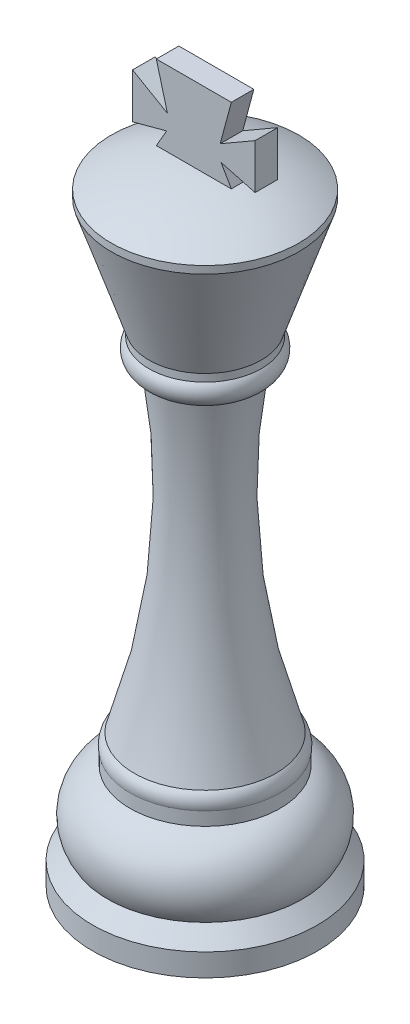
ISO-10303-21;
HEADER;
FILE_DESCRIPTION(('STEP AP214'),'2;1');
FILE_NAME('part.step','',(''),(''),'','','');
FILE_SCHEMA(('AUTOMOTIVE_DESIGN { 1 0 10303 214 1 1 1 1 }'));
ENDSEC;
DATA;
#1=APPLICATION_CONTEXT('core data for automotive mechanical design processes');
#2=APPLICATION_PROTOCOL_DEFINITION('international standard','automotive_design',2000,#1);
#3=PRODUCT_CONTEXT('',#1,'mechanical');
#4=PRODUCT('Part','Part','',(#3));
#5=PRODUCT_RELATED_PRODUCT_CATEGORY('part','',(#4));
#6=PRODUCT_DEFINITION_FORMATION('','',#4);
#7=PRODUCT_DEFINITION_CONTEXT('part definition',#1,'design');
#8=PRODUCT_DEFINITION('design','',#6,#7);
#9=PRODUCT_DEFINITION_SHAPE('','',#8);
#10=(LENGTH_UNIT() NAMED_UNIT(*) SI_UNIT(.MILLI.,.METRE.));
#11=(NAMED_UNIT(*) PLANE_ANGLE_UNIT() SI_UNIT($,.RADIAN.));
#12=(NAMED_UNIT(*) SI_UNIT($,.STERADIAN.) SOLID_ANGLE_UNIT());
#13=UNCERTAINTY_MEASURE_WITH_UNIT(LENGTH_MEASURE(1.E-05),#10,'distance_accuracy_value','');
#14=(GEOMETRIC_REPRESENTATION_CONTEXT(3) GLOBAL_UNCERTAINTY_ASSIGNED_CONTEXT((#13)) GLOBAL_UNIT_ASSIGNED_CONTEXT((#10,
#11,#12)) REPRESENTATION_CONTEXT('',''));
#15=CARTESIAN_POINT('',(0.,0.,0.));
#16=DIRECTION('',(0.,0.,1.));
#17=DIRECTION('',(1.,0.,0.));
#18=AXIS2_PLACEMENT_3D('',#15,#16,#17);
#19=CARTESIAN_POINT('',(4.99999998138486,83.7704314526692,1.5));
#20=DIRECTION('',(-8.62905338488984E-05,0.999999996276972,0.));
#21=DIRECTION('',(-0.999999996276972,-8.62905338488984E-05,0.));
#22=AXIS2_PLACEMENT_3D('',#19,#20,#21);
#23=PLANE('',#22);
#24=DIRECTION('',(0.999999996276972,8.62905338488984E-05,0.));
#25=VECTOR('',#24,1.);
#26=CARTESIAN_POINT('',(4.99999998138486,83.7704314526692,-1.5));
#27=LINE('',#26,#25);
#28=CARTESIAN_POINT('',(0.,83.77,-1.5));
#29=VERTEX_POINT('',#28);
#30=CARTESIAN_POINT('',(4.99999998138486,83.7704314526692,-1.5));
#31=VERTEX_POINT('',#30);
#32=EDGE_CURVE('E169',#29,#31,#27,.T.);
#33=ORIENTED_EDGE('',*,*,#32,.T.);
#34=DIRECTION('',(0.,0.,-1.));
#35=VECTOR('',#34,1.);
#36=CARTESIAN_POINT('',(4.99999998138486,83.7704314526692,1.5));
#37=LINE('',#36,#35);
#38=CARTESIAN_POINT('',(4.99999998138486,83.7704314526692,1.5));
#39=VERTEX_POINT('',#38);
#40=EDGE_CURVE('E12',#39,#31,#37,.T.);
#41=ORIENTED_EDGE('',*,*,#40,.F.);
#42=DIRECTION('',(0.999999996276972,8.62905338488984E-05,0.));
#43=VECTOR('',#42,1.);
#44=CARTESIAN_POINT('',(4.99999998138486,83.7704314526692,1.5));
#45=LINE('',#44,#43);
#46=CARTESIAN_POINT('',(0.,83.77,1.5));
#47=VERTEX_POINT('',#46);
#48=EDGE_CURVE('E193',#47,#39,#45,.T.);
#49=ORIENTED_EDGE('',*,*,#48,.F.);
#50=DIRECTION('',(0.,0.,-1.));
#51=VECTOR('',#50,1.);
#52=CARTESIAN_POINT('',(0.,83.77,1.5));
#53=LINE('',#52,#51);
#54=EDGE_CURVE('E165',#47,#29,#53,.T.);
#55=ORIENTED_EDGE('',*,*,#54,.T.);
#56=EDGE_LOOP('',(#33,#41,#49,#55));
#57=FACE_BOUND('',#56,.T.);
#58=ADVANCED_FACE('F43',(#57),#23,.F.);
#59=CARTESIAN_POINT('',(3.62807411526604,86.146676757005,1.5));
#60=DIRECTION('',(-0.866025403784438,-0.5,0.));
#61=DIRECTION('',(0.5,-0.866025403784439,0.));
#62=AXIS2_PLACEMENT_3D('',#59,#60,#61);
#63=PLANE('',#62);
#64=DIRECTION('',(-0.5,0.866025403784439,0.));
#65=VECTOR('',#64,1.);
#66=CARTESIAN_POINT('',(3.62807411526604,86.146676757005,-1.5));
#67=LINE('',#66,#65);
#68=CARTESIAN_POINT('',(3.62807411526604,86.146676757005,-1.5));
#69=VERTEX_POINT('',#68);
#70=EDGE_CURVE('E172',#31,#69,#67,.T.);
#71=ORIENTED_EDGE('',*,*,#70,.T.);
#72=DIRECTION('',(0.,0.,-1.));
#73=VECTOR('',#72,1.);
#74=CARTESIAN_POINT('',(3.62807411526604,86.146676757005,1.5));
#75=LINE('',#74,#73);
#76=CARTESIAN_POINT('',(3.62807411526604,86.146676757005,1.5));
#77=VERTEX_POINT('',#76);
#78=EDGE_CURVE('E51',#77,#69,#75,.T.);
#79=ORIENTED_EDGE('',*,*,#78,.F.);
#80=DIRECTION('',(-0.5,0.866025403784439,0.));
#81=VECTOR('',#80,1.);
#82=CARTESIAN_POINT('',(3.62807411526604,86.146676757005,1.5));
#83=LINE('',#82,#81);
#84=EDGE_CURVE('E117',#39,#77,#83,.T.);
#85=ORIENTED_EDGE('',*,*,#84,.F.);
#86=ORIENTED_EDGE('',*,*,#40,.T.);
#87=EDGE_LOOP('',(#71,#79,#85,#86));
#88=FACE_BOUND('',#87,.T.);
#89=ADVANCED_FACE('F276',(#88),#63,.F.);
#90=CARTESIAN_POINT('',(8.17135415939523,84.9293085381921,1.5));
#91=DIRECTION('',(0.258819045102526,0.965925826289067,0.));
#92=DIRECTION('',(-0.965925826289067,0.258819045102527,0.));
#93=AXIS2_PLACEMENT_3D('',#90,#91,#92);
#94=PLANE('',#93);
#95=DIRECTION('',(0.965925826289067,-0.258819045102527,0.));
#96=VECTOR('',#95,1.);
#97=CARTESIAN_POINT('',(8.17135415939523,84.9293085381921,-1.5));
#98=LINE('',#97,#96);
#99=CARTESIAN_POINT('',(8.17135415939523,84.9293085381921,-1.5));
#100=VERTEX_POINT('',#99);
#101=EDGE_CURVE('E174',#69,#100,#98,.T.);
#102=ORIENTED_EDGE('',*,*,#101,.T.);
#103=DIRECTION('',(0.,0.,-1.));
#104=VECTOR('',#103,1.);
#105=CARTESIAN_POINT('',(8.17135415939523,84.9293085381921,1.5));
#106=LINE('',#105,#104);
#107=CARTESIAN_POINT('',(8.17135415939523,84.9293085381921,1.5));
#108=VERTEX_POINT('',#107);
#109=EDGE_CURVE('E215',#108,#100,#106,.T.);
#110=ORIENTED_EDGE('',*,*,#109,.F.);
#111=DIRECTION('',(0.965925826289067,-0.258819045102527,0.));
#112=VECTOR('',#111,1.);
#113=CARTESIAN_POINT('',(8.17135415939523,84.9293085381921,1.5));
#114=LINE('',#113,#112);
#115=EDGE_CURVE('E223',#77,#108,#114,.T.);
#116=ORIENTED_EDGE('',*,*,#115,.F.);
#117=ORIENTED_EDGE('',*,*,#78,.T.);
#118=EDGE_LOOP('',(#102,#110,#116,#117));
#119=FACE_BOUND('',#118,.T.);
#120=ADVANCED_FACE('F221',(#119),#94,.F.);
#121=CARTESIAN_POINT('',(8.17135415939523,90.9293085381921,1.5));
#122=DIRECTION('',(-1.,0.,0.));
#123=DIRECTION('',(0.,-1.,0.));
#124=AXIS2_PLACEMENT_3D('',#121,#122,#123);
#125=PLANE('',#124);
#126=DIRECTION('',(0.,1.,0.));
#127=VECTOR('',#126,1.);
#128=CARTESIAN_POINT('',(8.17135415939523,90.9293085381921,-1.5));
#129=LINE('',#128,#127);
#130=CARTESIAN_POINT('',(8.17135415939523,90.9293085381921,-1.5));
#131=VERTEX_POINT('',#130);
#132=EDGE_CURVE('E176',#100,#131,#129,.T.);
#133=ORIENTED_EDGE('',*,*,#132,.T.);
#134=DIRECTION('',(0.,0.,-1.));
#135=VECTOR('',#134,1.);
#136=CARTESIAN_POINT('',(8.17135415939523,90.9293085381921,1.5));
#137=LINE('',#136,#135);
#138=CARTESIAN_POINT('',(8.17135415939523,90.9293085381921,1.5));
#139=VERTEX_POINT('',#138);
#140=EDGE_CURVE('E212',#139,#131,#137,.T.);
#141=ORIENTED_EDGE('',*,*,#140,.F.);
#142=DIRECTION('',(0.,1.,0.));
#143=VECTOR('',#142,1.);
#144=CARTESIAN_POINT('',(8.17135415939523,90.9293085381921,1.5));
#145=LINE('',#144,#143);
#146=EDGE_CURVE('E241',#108,#139,#145,.T.);
#147=ORIENTED_EDGE('',*,*,#146,.F.);
#148=ORIENTED_EDGE('',*,*,#109,.T.);
#149=EDGE_LOOP('',(#133,#141,#147,#148));
#150=FACE_BOUND('',#149,.T.);
#151=ADVANCED_FACE('F232',(#150),#125,.F.);
#152=CARTESIAN_POINT('',(3.51913879539559,88.2433507454588,1.5));
#153=DIRECTION('',(0.499999999999999,-0.866025403784439,0.));
#154=DIRECTION('',(0.866025403784439,0.499999999999999,0.));
#155=AXIS2_PLACEMENT_3D('',#152,#153,#154);
#156=PLANE('',#155);
#157=DIRECTION('',(-0.866025403784439,-0.499999999999999,0.));
#158=VECTOR('',#157,1.);
#159=CARTESIAN_POINT('',(3.51913879539559,88.2433507454588,-1.5));
#160=LINE('',#159,#158);
#161=CARTESIAN_POINT('',(3.51913879539559,88.2433507454588,-1.5));
#162=VERTEX_POINT('',#161);
#163=EDGE_CURVE('E178',#131,#162,#160,.T.);
#164=ORIENTED_EDGE('',*,*,#163,.T.);
#165=DIRECTION('',(0.,0.,-1.));
#166=VECTOR('',#165,1.);
#167=CARTESIAN_POINT('',(3.51913879539559,88.2433507454588,1.5));
#168=LINE('',#167,#166);
#169=CARTESIAN_POINT('',(3.51913879539559,88.2433507454588,1.5));
#170=VERTEX_POINT('',#169);
#171=EDGE_CURVE('E209',#170,#162,#168,.T.);
#172=ORIENTED_EDGE('',*,*,#171,.F.);
#173=DIRECTION('',(-0.866025403784439,-0.499999999999999,0.));
#174=VECTOR('',#173,1.);
#175=CARTESIAN_POINT('',(3.51913879539559,88.2433507454588,1.5));
#176=LINE('',#175,#174);
#177=EDGE_CURVE('E238',#139,#170,#176,.T.);
#178=ORIENTED_EDGE('',*,*,#177,.F.);
#179=ORIENTED_EDGE('',*,*,#140,.T.);
#180=EDGE_LOOP('',(#164,#172,#178,#179));
#181=FACE_BOUND('',#180,.T.);
#182=ADVANCED_FACE('F236',(#181),#156,.F.);
#183=CARTESIAN_POINT('',(5.,93.77,1.5));
#184=DIRECTION('',(-0.965925826289067,0.258819045102527,0.));
#185=DIRECTION('',(-0.258819045102527,-0.965925826289067,0.));
#186=AXIS2_PLACEMENT_3D('',#183,#184,#185);
#187=PLANE('',#186);
#188=DIRECTION('',(0.258819045102527,0.965925826289067,0.));
#189=VECTOR('',#188,1.);
#190=CARTESIAN_POINT('',(5.,93.77,-1.5));
#191=LINE('',#190,#189);
#192=CARTESIAN_POINT('',(5.,93.77,-1.5));
#193=VERTEX_POINT('',#192);
#194=EDGE_CURVE('E180',#162,#193,#191,.T.);
#195=ORIENTED_EDGE('',*,*,#194,.T.);
#196=DIRECTION('',(0.,0.,-1.));
#197=VECTOR('',#196,1.);
#198=CARTESIAN_POINT('',(5.,93.77,1.5));
#199=LINE('',#198,#197);
#200=CARTESIAN_POINT('',(5.,93.77,1.5));
#201=VERTEX_POINT('',#200);
#202=EDGE_CURVE('E206',#201,#193,#199,.T.);
#203=ORIENTED_EDGE('',*,*,#202,.F.);
#204=DIRECTION('',(0.258819045102527,0.965925826289067,0.));
#205=VECTOR('',#204,1.);
#206=CARTESIAN_POINT('',(5.,93.77,1.5));
#207=LINE('',#206,#205);
#208=EDGE_CURVE('E240',#170,#201,#207,.T.);
#209=ORIENTED_EDGE('',*,*,#208,.F.);
#210=ORIENTED_EDGE('',*,*,#171,.T.);
#211=EDGE_LOOP('',(#195,#203,#209,#210));
#212=FACE_BOUND('',#211,.T.);
#213=ADVANCED_FACE('F289',(#212),#187,.F.);
#214=CARTESIAN_POINT('',(5.,93.77,1.5));
#215=DIRECTION('',(0.,-1.,0.));
#216=DIRECTION('',(0.,0.,-1.));
#217=AXIS2_PLACEMENT_3D('',#214,#215,#216);
#218=PLANE('',#217);
#219=DIRECTION('',(-1.,0.,0.));
#220=VECTOR('',#219,1.);
#221=CARTESIAN_POINT('',(5.,93.77,-1.5));
#222=LINE('',#221,#220);
#223=CARTESIAN_POINT('',(-5.,93.77,-1.5));
#224=VERTEX_POINT('',#223);
#225=EDGE_CURVE('E182',#193,#224,#222,.T.);
#226=ORIENTED_EDGE('',*,*,#225,.T.);
#227=DIRECTION('',(0.,0.,-1.));
#228=VECTOR('',#227,1.);
#229=CARTESIAN_POINT('',(-5.,93.77,1.5));
#230=LINE('',#229,#228);
#231=CARTESIAN_POINT('',(-5.,93.77,1.5));
#232=VERTEX_POINT('',#231);
#233=EDGE_CURVE('E203',#232,#224,#230,.T.);
#234=ORIENTED_EDGE('',*,*,#233,.F.);
#235=DIRECTION('',(-1.,0.,0.));
#236=VECTOR('',#235,1.);
#237=CARTESIAN_POINT('',(5.,93.77,1.5));
#238=LINE('',#237,#236);
#239=EDGE_CURVE('E243',#201,#232,#238,.T.);
#240=ORIENTED_EDGE('',*,*,#239,.F.);
#241=ORIENTED_EDGE('',*,*,#202,.T.);
#242=EDGE_LOOP('',(#226,#234,#240,#241));
#243=FACE_BOUND('',#242,.T.);
#244=ADVANCED_FACE('F292',(#243),#218,.F.);
#245=CARTESIAN_POINT('',(-5.,93.77,1.5));
#246=DIRECTION('',(0.965925826289067,0.258819045102527,0.));
#247=DIRECTION('',(-0.258819045102527,0.965925826289067,0.));
#248=AXIS2_PLACEMENT_3D('',#245,#246,#247);
#249=PLANE('',#248);
#250=DIRECTION('',(0.258819045102527,-0.965925826289067,0.));
#251=VECTOR('',#250,1.);
#252=CARTESIAN_POINT('',(-5.,93.77,-1.5));
#253=LINE('',#252,#251);
#254=CARTESIAN_POINT('',(-3.51913879539559,88.2433507454588,-1.5));
#255=VERTEX_POINT('',#254);
#256=EDGE_CURVE('E184',#224,#255,#253,.T.);
#257=ORIENTED_EDGE('',*,*,#256,.T.);
#258=DIRECTION('',(0.,0.,-1.));
#259=VECTOR('',#258,1.);
#260=CARTESIAN_POINT('',(-3.51913879539559,88.2433507454588,1.5));
#261=LINE('',#260,#259);
#262=CARTESIAN_POINT('',(-3.51913879539559,88.2433507454588,1.5));
#263=VERTEX_POINT('',#262);
#264=EDGE_CURVE('E200',#263,#255,#261,.T.);
#265=ORIENTED_EDGE('',*,*,#264,.F.);
#266=DIRECTION('',(0.258819045102527,-0.965925826289067,0.));
#267=VECTOR('',#266,1.);
#268=CARTESIAN_POINT('',(-5.,93.77,1.5));
#269=LINE('',#268,#267);
#270=EDGE_CURVE('E249',#232,#263,#269,.T.);
#271=ORIENTED_EDGE('',*,*,#270,.F.);
#272=ORIENTED_EDGE('',*,*,#233,.T.);
#273=EDGE_LOOP('',(#257,#265,#271,#272));
#274=FACE_BOUND('',#273,.T.);
#275=ADVANCED_FACE('F296',(#274),#249,.F.);
#276=CARTESIAN_POINT('',(-3.51913879539559,88.2433507454588,1.5));
#277=DIRECTION('',(-0.499999999999999,-0.866025403784439,0.));
#278=DIRECTION('',(0.866025403784439,-0.499999999999999,0.));
#279=AXIS2_PLACEMENT_3D('',#276,#277,#278);
#280=PLANE('',#279);
#281=DIRECTION('',(-0.866025403784439,0.499999999999999,0.));
#282=VECTOR('',#281,1.);
#283=CARTESIAN_POINT('',(-3.51913879539559,88.2433507454588,-1.5));
#284=LINE('',#283,#282);
#285=CARTESIAN_POINT('',(-8.17135415939523,90.9293085381921,-1.5));
#286=VERTEX_POINT('',#285);
#287=EDGE_CURVE('E186',#255,#286,#284,.T.);
#288=ORIENTED_EDGE('',*,*,#287,.T.);
#289=DIRECTION('',(0.,0.,-1.));
#290=VECTOR('',#289,1.);
#291=CARTESIAN_POINT('',(-8.17135415939523,90.9293085381921,1.5));
#292=LINE('',#291,#290);
#293=CARTESIAN_POINT('',(-8.17135415939523,90.9293085381921,1.5));
#294=VERTEX_POINT('',#293);
#295=EDGE_CURVE('E197',#294,#286,#292,.T.);
#296=ORIENTED_EDGE('',*,*,#295,.F.);
#297=DIRECTION('',(-0.866025403784439,0.499999999999999,0.));
#298=VECTOR('',#297,1.);
#299=CARTESIAN_POINT('',(-3.51913879539559,88.2433507454588,1.5));
#300=LINE('',#299,#298);
#301=EDGE_CURVE('E251',#263,#294,#300,.T.);
#302=ORIENTED_EDGE('',*,*,#301,.F.);
#303=ORIENTED_EDGE('',*,*,#264,.T.);
#304=EDGE_LOOP('',(#288,#296,#302,#303));
#305=FACE_BOUND('',#304,.T.);
#306=ADVANCED_FACE('F257',(#305),#280,.F.);
#307=CARTESIAN_POINT('',(-8.17135415939523,90.9293085381921,1.5));
#308=DIRECTION('',(1.,0.,0.));
#309=DIRECTION('',(0.,1.,0.));
#310=AXIS2_PLACEMENT_3D('',#307,#308,#309);
#311=PLANE('',#310);
#312=DIRECTION('',(0.,-1.,0.));
#313=VECTOR('',#312,1.);
#314=CARTESIAN_POINT('',(-8.17135415939523,90.9293085381921,-1.5));
#315=LINE('',#314,#313);
#316=CARTESIAN_POINT('',(-8.17135415939523,84.9293085381921,-1.5));
#317=VERTEX_POINT('',#316);
#318=EDGE_CURVE('E188',#286,#317,#315,.T.);
#319=ORIENTED_EDGE('',*,*,#318,.T.);
#320=DIRECTION('',(0.,0.,-1.));
#321=VECTOR('',#320,1.);
#322=CARTESIAN_POINT('',(-8.17135415939523,84.9293085381921,1.5));
#323=LINE('',#322,#321);
#324=CARTESIAN_POINT('',(-8.17135415939523,84.9293085381921,1.5));
#325=VERTEX_POINT('',#324);
#326=EDGE_CURVE('E160',#325,#317,#323,.T.);
#327=ORIENTED_EDGE('',*,*,#326,.F.);
#328=DIRECTION('',(0.,-1.,0.));
#329=VECTOR('',#328,1.);
#330=CARTESIAN_POINT('',(-8.17135415939523,90.9293085381921,1.5));
#331=LINE('',#330,#329);
#332=EDGE_CURVE('E151',#294,#325,#331,.T.);
#333=ORIENTED_EDGE('',*,*,#332,.F.);
#334=ORIENTED_EDGE('',*,*,#295,.T.);
#335=EDGE_LOOP('',(#319,#327,#333,#334));
#336=FACE_BOUND('',#335,.T.);
#337=ADVANCED_FACE('F261',(#336),#311,.F.);
#338=CARTESIAN_POINT('',(-8.17135415939523,84.9293085381921,1.5));
#339=DIRECTION('',(-0.258819045102526,0.965925826289067,0.));
#340=DIRECTION('',(-0.965925826289067,-0.258819045102526,0.));
#341=AXIS2_PLACEMENT_3D('',#338,#339,#340);
#342=PLANE('',#341);
#343=DIRECTION('',(0.965925826289067,0.258819045102526,0.));
#344=VECTOR('',#343,1.);
#345=CARTESIAN_POINT('',(-8.17135415939523,84.9293085381921,-1.5));
#346=LINE('',#345,#344);
#347=CARTESIAN_POINT('',(-3.62807411526604,86.146676757005,-1.5));
#348=VERTEX_POINT('',#347);
#349=EDGE_CURVE('E159',#317,#348,#346,.T.);
#350=ORIENTED_EDGE('',*,*,#349,.T.);
#351=DIRECTION('',(0.,0.,-1.));
#352=VECTOR('',#351,1.);
#353=CARTESIAN_POINT('',(-3.62807411526604,86.146676757005,1.5));
#354=LINE('',#353,#352);
#355=CARTESIAN_POINT('',(-3.62807411526604,86.146676757005,1.5));
#356=VERTEX_POINT('',#355);
#357=EDGE_CURVE('E156',#356,#348,#354,.T.);
#358=ORIENTED_EDGE('',*,*,#357,.F.);
#359=DIRECTION('',(0.965925826289067,0.258819045102526,0.));
#360=VECTOR('',#359,1.);
#361=CARTESIAN_POINT('',(-8.17135415939523,84.9293085381921,1.5));
#362=LINE('',#361,#360);
#363=EDGE_CURVE('E145',#325,#356,#362,.T.);
#364=ORIENTED_EDGE('',*,*,#363,.F.);
#365=ORIENTED_EDGE('',*,*,#326,.T.);
#366=EDGE_LOOP('',(#350,#358,#364,#365));
#367=FACE_BOUND('',#366,.T.);
#368=ADVANCED_FACE('F157',(#367),#342,.F.);
#369=CARTESIAN_POINT('',(-3.62807411526604,86.146676757005,1.5));
#370=DIRECTION('',(0.866025403784438,-0.5,0.));
#371=DIRECTION('',(0.5,0.866025403784438,0.));
#372=AXIS2_PLACEMENT_3D('',#369,#370,#371);
#373=PLANE('',#372);
#374=DIRECTION('',(-0.5,-0.866025403784438,0.));
#375=VECTOR('',#374,1.);
#376=CARTESIAN_POINT('',(-3.62807411526604,86.146676757005,-1.5));
#377=LINE('',#376,#375);
#378=CARTESIAN_POINT('',(-4.99999998138486,83.7704314526692,-1.5));
#379=VERTEX_POINT('',#378);
#380=EDGE_CURVE('E103',#348,#379,#377,.T.);
#381=ORIENTED_EDGE('',*,*,#380,.T.);
#382=DIRECTION('',(0.,0.,-1.));
#383=VECTOR('',#382,1.);
#384=CARTESIAN_POINT('',(-4.99999998138486,83.7704314526692,1.5));
#385=LINE('',#384,#383);
#386=CARTESIAN_POINT('',(-4.99999998138486,83.7704314526692,1.5));
#387=VERTEX_POINT('',#386);
#388=EDGE_CURVE('E161',#387,#379,#385,.T.);
#389=ORIENTED_EDGE('',*,*,#388,.F.);
#390=DIRECTION('',(-0.5,-0.866025403784438,0.));
#391=VECTOR('',#390,1.);
#392=CARTESIAN_POINT('',(-3.62807411526604,86.146676757005,1.5));
#393=LINE('',#392,#391);
#394=EDGE_CURVE('E149',#356,#387,#393,.T.);
#395=ORIENTED_EDGE('',*,*,#394,.F.);
#396=ORIENTED_EDGE('',*,*,#357,.T.);
#397=EDGE_LOOP('',(#381,#389,#395,#396));
#398=FACE_BOUND('',#397,.T.);
#399=ADVANCED_FACE('F163',(#398),#373,.F.);
#400=CARTESIAN_POINT('',(-4.99999998138486,83.7704314526692,1.5));
#401=DIRECTION('',(8.62905338488984E-05,0.999999996276972,0.));
#402=DIRECTION('',(-0.999999996276972,8.62905338488984E-05,0.));
#403=AXIS2_PLACEMENT_3D('',#400,#401,#402);
#404=PLANE('',#403);
#405=DIRECTION('',(0.999999996276972,-8.62905338488984E-05,0.));
#406=VECTOR('',#405,1.);
#407=CARTESIAN_POINT('',(-4.99999998138486,83.7704314526692,-1.5));
#408=LINE('',#407,#406);
#409=EDGE_CURVE('E109',#379,#29,#408,.T.);
#410=ORIENTED_EDGE('',*,*,#409,.T.);
#411=ORIENTED_EDGE('',*,*,#54,.F.);
#412=DIRECTION('',(0.999999996276972,-8.62905338488984E-05,0.));
#413=VECTOR('',#412,1.);
#414=CARTESIAN_POINT('',(-4.99999998138486,83.7704314526692,1.5));
#415=LINE('',#414,#413);
#416=EDGE_CURVE('E59',#387,#47,#415,.T.);
#417=ORIENTED_EDGE('',*,*,#416,.F.);
#418=ORIENTED_EDGE('',*,*,#388,.T.);
#419=EDGE_LOOP('',(#410,#411,#417,#418));
#420=FACE_BOUND('',#419,.T.);
#421=ADVANCED_FACE('F265',(#420),#404,.F.);
#422=CARTESIAN_POINT('',(0.,0.,1.5));
#423=DIRECTION('',(0.,0.,1.));
#424=DIRECTION('',(1.,0.,0.));
#425=AXIS2_PLACEMENT_3D('',#422,#423,#424);
#426=PLANE('',#425);
#427=ORIENTED_EDGE('',*,*,#48,.T.);
#428=ORIENTED_EDGE('',*,*,#84,.T.);
#429=ORIENTED_EDGE('',*,*,#115,.T.);
#430=ORIENTED_EDGE('',*,*,#146,.T.);
#431=ORIENTED_EDGE('',*,*,#177,.T.);
#432=ORIENTED_EDGE('',*,*,#208,.T.);
#433=ORIENTED_EDGE('',*,*,#239,.T.);
#434=ORIENTED_EDGE('',*,*,#270,.T.);
#435=ORIENTED_EDGE('',*,*,#301,.T.);
#436=ORIENTED_EDGE('',*,*,#332,.T.);
#437=ORIENTED_EDGE('',*,*,#363,.T.);
#438=ORIENTED_EDGE('',*,*,#394,.T.);
#439=ORIENTED_EDGE('',*,*,#416,.T.);
#440=EDGE_LOOP('',(#427,#428,#429,#430,#431,#432,#433,#434,#435,#436,#437,#438,#439));
#441=FACE_BOUND('',#440,.T.);
#442=ADVANCED_FACE('F147',(#441),#426,.T.);
#443=CARTESIAN_POINT('',(0.,0.,-1.5));
#444=DIRECTION('',(0.,0.,1.));
#445=DIRECTION('',(1.,0.,0.));
#446=AXIS2_PLACEMENT_3D('',#443,#444,#445);
#447=PLANE('',#446);
#448=ORIENTED_EDGE('',*,*,#32,.F.);
#449=ORIENTED_EDGE('',*,*,#409,.F.);
#450=ORIENTED_EDGE('',*,*,#380,.F.);
#451=ORIENTED_EDGE('',*,*,#349,.F.);
#452=ORIENTED_EDGE('',*,*,#318,.F.);
#453=ORIENTED_EDGE('',*,*,#287,.F.);
#454=ORIENTED_EDGE('',*,*,#256,.F.);
#455=ORIENTED_EDGE('',*,*,#225,.F.);
#456=ORIENTED_EDGE('',*,*,#194,.F.);
#457=ORIENTED_EDGE('',*,*,#163,.F.);
#458=ORIENTED_EDGE('',*,*,#132,.F.);
#459=ORIENTED_EDGE('',*,*,#101,.F.);
#460=ORIENTED_EDGE('',*,*,#70,.F.);
#461=EDGE_LOOP('',(#448,#449,#450,#451,#452,#453,#454,#455,#456,#457,#458,#459,#460));
#462=FACE_BOUND('',#461,.T.);
#463=ADVANCED_FACE('F227',(#462),#447,.F.);
#464=CLOSED_SHELL('',(#58,#89,#120,#151,#182,#213,#244,#275,#306,#337,#368,#399,#421,#442,#463));
#465=MANIFOLD_SOLID_BREP('B2',#464);
#466=CARTESIAN_POINT('',(0.,0.,0.));
#467=DIRECTION('',(0.,1.,0.));
#468=DIRECTION('',(0.,0.,1.));
#469=AXIS2_PLACEMENT_3D('',#466,#467,#468);
#470=PLANE('',#469);
#471=CARTESIAN_POINT('',(0.,0.,0.));
#472=DIRECTION('',(0.,-1.,0.));
#473=DIRECTION('',(0.,0.,-1.));
#474=AXIS2_PLACEMENT_3D('',#471,#472,#473);
#475=CIRCLE('',#474,15.);
#476=CARTESIAN_POINT('',(0.,0.,-15.));
#477=VERTEX_POINT('',#476);
#478=EDGE_CURVE('E41',#477,#477,#475,.T.);
#479=ORIENTED_EDGE('',*,*,#478,.T.);
#480=EDGE_LOOP('',(#479));
#481=FACE_BOUND('',#480,.T.);
#482=ADVANCED_FACE('F401',(#481),#470,.F.);
#483=CARTESIAN_POINT('',(0.,-79.6930157502169,0.));
#484=DIRECTION('',(0.,-1.,0.));
#485=DIRECTION('',(0.,0.,-1.));
#486=AXIS2_PLACEMENT_3D('',#483,#484,#485);
#487=CYLINDRICAL_SURFACE('',#486,15.);
#488=ORIENTED_EDGE('',*,*,#478,.F.);
#489=EDGE_LOOP('',(#488));
#490=FACE_BOUND('',#489,.T.);
#491=CARTESIAN_POINT('',(0.,3.,0.));
#492=DIRECTION('',(0.,-1.,0.));
#493=DIRECTION('',(0.,0.,-1.));
#494=AXIS2_PLACEMENT_3D('',#491,#492,#493);
#495=CIRCLE('',#494,15.);
#496=CARTESIAN_POINT('',(0.,3.,-15.));
#497=VERTEX_POINT('',#496);
#498=EDGE_CURVE('E407',#497,#497,#495,.T.);
#499=ORIENTED_EDGE('',*,*,#498,.T.);
#500=EDGE_LOOP('',(#499));
#501=FACE_BOUND('',#500,.T.);
#502=ADVANCED_FACE('F423',(#490,#501),#487,.T.);
#503=CARTESIAN_POINT('',(0.,5.,0.));
#504=DIRECTION('',(0.,-1.,0.));
#505=DIRECTION('',(0.,0.,-1.));
#506=AXIS2_PLACEMENT_3D('',#503,#504,#505);
#507=CONICAL_SURFACE('',#506,13.,0.785398163397448);
#508=ORIENTED_EDGE('',*,*,#498,.F.);
#509=EDGE_LOOP('',(#508));
#510=FACE_BOUND('',#509,.T.);
#511=CARTESIAN_POINT('',(0.,5.,0.));
#512=DIRECTION('',(0.,-1.,0.));
#513=DIRECTION('',(0.,0.,-1.));
#514=AXIS2_PLACEMENT_3D('',#511,#512,#513);
#515=CIRCLE('',#514,13.);
#516=CARTESIAN_POINT('',(0.,5.,-13.));
#517=VERTEX_POINT('',#516);
#518=EDGE_CURVE('E435',#517,#517,#515,.T.);
#519=ORIENTED_EDGE('',*,*,#518,.T.);
#520=EDGE_LOOP('',(#519));
#521=FACE_BOUND('',#520,.T.);
#522=ADVANCED_FACE('F428',(#510,#521),#507,.T.);
#523=CARTESIAN_POINT('',(0.,8.31380661428567,0.));
#524=DIRECTION('',(0.,-1.,0.));
#525=DIRECTION('',(0.,0.,-1.));
#526=AXIS2_PLACEMENT_3D('',#523,#524,#525);
#527=TOROIDAL_SURFACE('',#526,7.99813177671417,6.);
#528=ORIENTED_EDGE('',*,*,#518,.F.);
#529=EDGE_LOOP('',(#528));
#530=FACE_BOUND('',#529,.T.);
#531=CARTESIAN_POINT('',(0.,13.97,0.));
#532=DIRECTION('',(0.,-1.,0.));
#533=DIRECTION('',(0.,0.,-1.));
#534=AXIS2_PLACEMENT_3D('',#531,#532,#533);
#535=CIRCLE('',#534,10.);
#536=CARTESIAN_POINT('',(0.,13.97,-10.));
#537=VERTEX_POINT('',#536);
#538=EDGE_CURVE('E437',#537,#537,#535,.T.);
#539=ORIENTED_EDGE('',*,*,#538,.T.);
#540=EDGE_LOOP('',(#539));
#541=FACE_BOUND('',#540,.T.);
#542=ADVANCED_FACE('F491',(#530,#541),#527,.T.);
#543=CARTESIAN_POINT('',(0.,-79.6930157502169,0.));
#544=DIRECTION('',(0.,-1.,0.));
#545=DIRECTION('',(0.,0.,-1.));
#546=AXIS2_PLACEMENT_3D('',#543,#544,#545);
#547=CYLINDRICAL_SURFACE('',#546,10.);
#548=ORIENTED_EDGE('',*,*,#538,.F.);
#549=EDGE_LOOP('',(#548));
#550=FACE_BOUND('',#549,.T.);
#551=CARTESIAN_POINT('',(0.,15.75,0.));
#552=DIRECTION('',(0.,-1.,0.));
#553=DIRECTION('',(0.,0.,-1.));
#554=AXIS2_PLACEMENT_3D('',#551,#552,#553);
#555=CIRCLE('',#554,10.);
#556=CARTESIAN_POINT('',(0.,15.75,-10.));
#557=VERTEX_POINT('',#556);
#558=EDGE_CURVE('E442',#557,#557,#555,.T.);
#559=ORIENTED_EDGE('',*,*,#558,.T.);
#560=EDGE_LOOP('',(#559));
#561=FACE_BOUND('',#560,.T.);
#562=ADVANCED_FACE('F487',(#550,#561),#547,.T.);
#563=CARTESIAN_POINT('',(0.,16.2965610934731,0.));
#564=DIRECTION('',(0.,-1.,0.));
#565=DIRECTION('',(0.,0.,-1.));
#566=AXIS2_PLACEMENT_3D('',#563,#564,#565);
#567=TOROIDAL_SURFACE('',#566,8.07613124899292,2.);
#568=ORIENTED_EDGE('',*,*,#558,.F.);
#569=EDGE_LOOP('',(#568));
#570=FACE_BOUND('',#569,.T.);
#571=CARTESIAN_POINT('',(0.,17.75,0.));
#572=DIRECTION('',(0.,-1.,0.));
#573=DIRECTION('',(0.,0.,-1.));
#574=AXIS2_PLACEMENT_3D('',#571,#572,#573);
#575=CIRCLE('',#574,9.45);
#576=CARTESIAN_POINT('',(0.,17.75,-9.45));
#577=VERTEX_POINT('',#576);
#578=EDGE_CURVE('E445',#577,#577,#575,.T.);
#579=ORIENTED_EDGE('',*,*,#578,.T.);
#580=EDGE_LOOP('',(#579));
#581=FACE_BOUND('',#580,.T.);
#582=ADVANCED_FACE('F483',(#570,#581),#567,.T.);
#583=CARTESIAN_POINT('',(0.,46.0519475415137,0.));
#584=DIRECTION('',(0.,-1.,0.));
#585=DIRECTION('',(0.,0.,-1.));
#586=AXIS2_PLACEMENT_3D('',#583,#584,#585);
#587=TOROIDAL_SURFACE('',#586,94.8841838221529,90.);
#588=ORIENTED_EDGE('',*,*,#578,.F.);
#589=EDGE_LOOP('',(#588));
#590=FACE_BOUND('',#589,.T.);
#591=CARTESIAN_POINT('',(0.,60.18,0.));
#592=DIRECTION('',(0.,-1.,0.));
#593=DIRECTION('',(0.,0.,-1.));
#594=AXIS2_PLACEMENT_3D('',#591,#592,#593);
#595=CIRCLE('',#594,6.00000000000001);
#596=CARTESIAN_POINT('',(0.,60.18,-6.00000000000001));
#597=VERTEX_POINT('',#596);
#598=EDGE_CURVE('E448',#597,#597,#595,.T.);
#599=ORIENTED_EDGE('',*,*,#598,.T.);
#600=EDGE_LOOP('',(#599));
#601=FACE_BOUND('',#600,.T.);
#602=ADVANCED_FACE('F479',(#590,#601),#587,.F.);
#603=CARTESIAN_POINT('',(0.,62.1799984000374,0.));
#604=DIRECTION('',(0.,-1.,0.));
#605=DIRECTION('',(0.,0.,-1.));
#606=AXIS2_PLACEMENT_3D('',#603,#604,#605);
#607=TOROIDAL_SURFACE('',#606,5.9974702079173,2.);
#608=ORIENTED_EDGE('',*,*,#598,.F.);
#609=EDGE_LOOP('',(#608));
#610=FACE_BOUND('',#609,.T.);
#611=CARTESIAN_POINT('',(0.,63.5,0.));
#612=DIRECTION('',(0.,-1.,0.));
#613=DIRECTION('',(0.,0.,-1.));
#614=AXIS2_PLACEMENT_3D('',#611,#612,#613);
#615=CIRCLE('',#614,7.5);
#616=CARTESIAN_POINT('',(0.,63.5,-7.5));
#617=VERTEX_POINT('',#616);
#618=EDGE_CURVE('E451',#617,#617,#615,.T.);
#619=ORIENTED_EDGE('',*,*,#618,.T.);
#620=EDGE_LOOP('',(#619));
#621=FACE_BOUND('',#620,.T.);
#622=ADVANCED_FACE('F472',(#610,#621),#607,.T.);
#623=CARTESIAN_POINT('',(0.,-79.6930157502169,0.));
#624=DIRECTION('',(0.,-1.,0.));
#625=DIRECTION('',(0.,0.,-1.));
#626=AXIS2_PLACEMENT_3D('',#623,#624,#625);
#627=CYLINDRICAL_SURFACE('',#626,7.5);
#628=ORIENTED_EDGE('',*,*,#618,.F.);
#629=EDGE_LOOP('',(#628));
#630=FACE_BOUND('',#629,.T.);
#631=CARTESIAN_POINT('',(0.,64.5,0.));
#632=DIRECTION('',(0.,-1.,0.));
#633=DIRECTION('',(0.,0.,-1.));
#634=AXIS2_PLACEMENT_3D('',#631,#632,#633);
#635=CIRCLE('',#634,7.5);
#636=CARTESIAN_POINT('',(0.,64.5,-7.5));
#637=VERTEX_POINT('',#636);
#638=EDGE_CURVE('E454',#637,#637,#635,.T.);
#639=ORIENTED_EDGE('',*,*,#638,.T.);
#640=EDGE_LOOP('',(#639));
#641=FACE_BOUND('',#640,.T.);
#642=ADVANCED_FACE('F466',(#630,#641),#627,.T.);
#643=CARTESIAN_POINT('',(0.,79.5,0.));
#644=DIRECTION('',(0.,1.,0.));
#645=DIRECTION('',(0.,0.,1.));
#646=AXIS2_PLACEMENT_3D('',#643,#644,#645);
#647=CONICAL_SURFACE('',#646,12.5,0.321750554396643);
#648=ORIENTED_EDGE('',*,*,#638,.F.);
#649=EDGE_LOOP('',(#648));
#650=FACE_BOUND('',#649,.T.);
#651=CARTESIAN_POINT('',(0.,79.5,0.));
#652=DIRECTION('',(0.,-1.,0.));
#653=DIRECTION('',(0.,0.,-1.));
#654=AXIS2_PLACEMENT_3D('',#651,#652,#653);
#655=CIRCLE('',#654,12.5);
#656=CARTESIAN_POINT('',(0.,79.5,-12.5));
#657=VERTEX_POINT('',#656);
#658=EDGE_CURVE('E457',#657,#657,#655,.T.);
#659=ORIENTED_EDGE('',*,*,#658,.T.);
#660=EDGE_LOOP('',(#659));
#661=FACE_BOUND('',#660,.T.);
#662=ADVANCED_FACE('F418',(#650,#661),#647,.T.);
#663=CARTESIAN_POINT('',(0.,-79.6930157502169,0.));
#664=DIRECTION('',(0.,-1.,0.));
#665=DIRECTION('',(0.,0.,-1.));
#666=AXIS2_PLACEMENT_3D('',#663,#664,#665);
#667=CYLINDRICAL_SURFACE('',#666,12.5);
#668=ORIENTED_EDGE('',*,*,#658,.F.);
#669=EDGE_LOOP('',(#668));
#670=FACE_BOUND('',#669,.T.);
#671=CARTESIAN_POINT('',(0.,80.5,0.));
#672=DIRECTION('',(0.,-1.,0.));
#673=DIRECTION('',(0.,0.,-1.));
#674=AXIS2_PLACEMENT_3D('',#671,#672,#673);
#675=CIRCLE('',#674,12.5);
#676=CARTESIAN_POINT('',(0.,80.5,-12.5));
#677=VERTEX_POINT('',#676);
#678=EDGE_CURVE('E460',#677,#677,#675,.T.);
#679=ORIENTED_EDGE('',*,*,#678,.T.);
#680=EDGE_LOOP('',(#679));
#681=FACE_BOUND('',#680,.T.);
#682=ADVANCED_FACE('F412',(#670,#681),#667,.T.);
#683=CARTESIAN_POINT('',(0.,58.7703798644241,-0.137815372533345));
#684=DIRECTION('',(-1.,0.,0.));
#685=DIRECTION('',(0.,0.,-1.));
#686=AXIS2_PLACEMENT_3D('',#683,#684,#685);
#687=CIRCLE('',#686,25.);
#688=TRIMMED_CURVE('',#687,(PARAMETER_VALUE(-1.57630896961702)),
(PARAMETER_VALUE(1.57630896961702)),.T.,.PARAMETER.);
#689=CARTESIAN_POINT('',(0.,58.7703798644241,0.));
#690=DIRECTION('',(0.,-1.,0.));
#691=AXIS1_PLACEMENT('',#689,#690);
#692=SURFACE_OF_REVOLUTION('',#688,#691);
#693=ORIENTED_EDGE('',*,*,#678,.F.);
#694=EDGE_LOOP('',(#693));
#695=FACE_BOUND('',#694,.T.);
#696=CARTESIAN_POINT('',(0.,83.77,0.));
#697=VERTEX_POINT('',#696);
#698=VERTEX_LOOP('',#697);
#699=FACE_BOUND('',#698,.T.);
#700=ADVANCED_FACE('F410',(#695,#699),#692,.T.);
#701=CLOSED_SHELL('',(#482,#502,#522,#542,#562,#582,#602,#622,#642,#662,#682,#700));
#702=MANIFOLD_SOLID_BREP('B6',#701);
#703=ADVANCED_BREP_SHAPE_REPRESENTATION('',(#18,#465,#702),#14);
#704=SHAPE_DEFINITION_REPRESENTATION(#9,#703);
ENDSEC;
END-ISO-10303-21;
